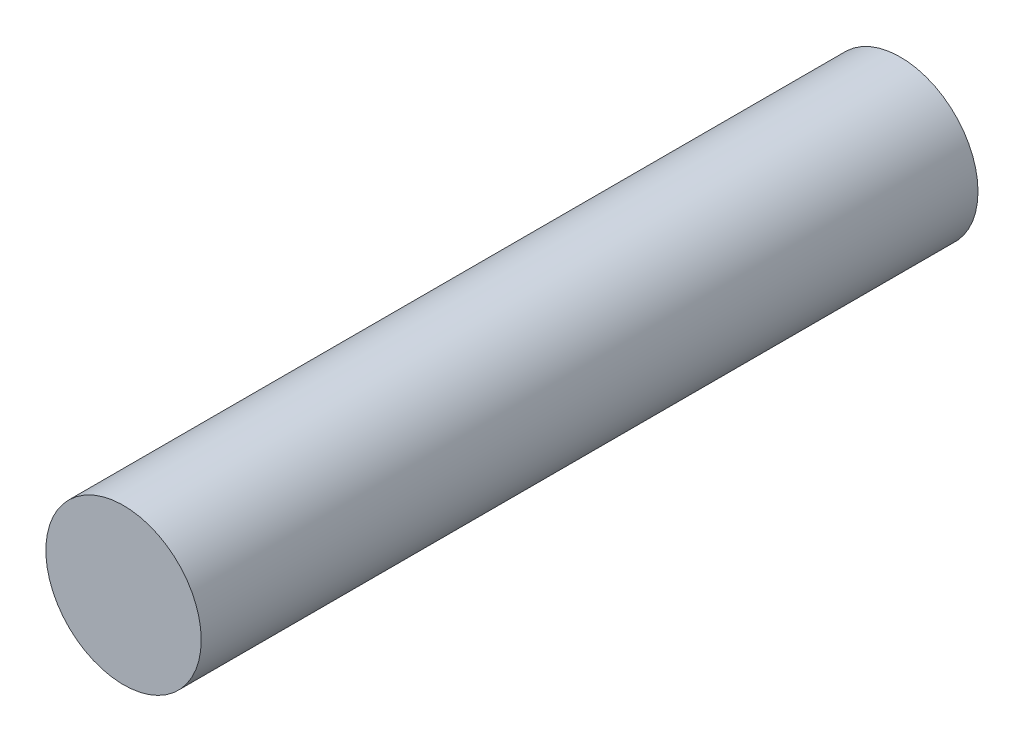
ISO-10303-21;
HEADER;
FILE_DESCRIPTION(('STEP AP214'),'2;1');
FILE_NAME('part.step','',(''),(''),'','','');
FILE_SCHEMA(('AUTOMOTIVE_DESIGN { 1 0 10303 214 1 1 1 1 }'));
ENDSEC;
DATA;
#1=APPLICATION_CONTEXT('core data for automotive mechanical design processes');
#2=APPLICATION_PROTOCOL_DEFINITION('international standard','automotive_design',2000,#1);
#3=PRODUCT_CONTEXT('',#1,'mechanical');
#4=PRODUCT('Part','Part','',(#3));
#5=PRODUCT_RELATED_PRODUCT_CATEGORY('part','',(#4));
#6=PRODUCT_DEFINITION_FORMATION('','',#4);
#7=PRODUCT_DEFINITION_CONTEXT('part definition',#1,'design');
#8=PRODUCT_DEFINITION('design','',#6,#7);
#9=PRODUCT_DEFINITION_SHAPE('','',#8);
#10=(LENGTH_UNIT() NAMED_UNIT(*) SI_UNIT(.MILLI.,.METRE.));
#11=(NAMED_UNIT(*) PLANE_ANGLE_UNIT() SI_UNIT($,.RADIAN.));
#12=(NAMED_UNIT(*) SI_UNIT($,.STERADIAN.) SOLID_ANGLE_UNIT());
#13=UNCERTAINTY_MEASURE_WITH_UNIT(LENGTH_MEASURE(1.E-05),#10,'distance_accuracy_value','');
#14=(GEOMETRIC_REPRESENTATION_CONTEXT(3) GLOBAL_UNCERTAINTY_ASSIGNED_CONTEXT((#13)) GLOBAL_UNIT_ASSIGNED_CONTEXT((#10,
#11,#12)) REPRESENTATION_CONTEXT('',''));
#15=CARTESIAN_POINT('',(0.,0.,0.));
#16=DIRECTION('',(0.,0.,1.));
#17=DIRECTION('',(1.,0.,0.));
#18=AXIS2_PLACEMENT_3D('',#15,#16,#17);
#19=CARTESIAN_POINT('',(0.,0.,100.));
#20=DIRECTION('',(0.,0.,-1.));
#21=DIRECTION('',(-1.,0.,0.));
#22=AXIS2_PLACEMENT_3D('',#19,#20,#21);
#23=CYLINDRICAL_SURFACE('',#22,10.);
#24=CARTESIAN_POINT('',(0.,0.,100.));
#25=DIRECTION('',(0.,0.,1.));
#26=DIRECTION('',(1.,0.,0.));
#27=AXIS2_PLACEMENT_3D('',#24,#25,#26);
#28=CIRCLE('',#27,10.);
#29=CARTESIAN_POINT('',(10.,0.,100.));
#30=VERTEX_POINT('',#29);
#31=EDGE_CURVE('E10',#30,#30,#28,.T.);
#32=ORIENTED_EDGE('',*,*,#31,.F.);
#33=EDGE_LOOP('',(#32));
#34=FACE_BOUND('',#33,.T.);
#35=CARTESIAN_POINT('',(0.,0.,0.));
#36=DIRECTION('',(0.,0.,1.));
#37=DIRECTION('',(1.,0.,0.));
#38=AXIS2_PLACEMENT_3D('',#35,#36,#37);
#39=CIRCLE('',#38,10.);
#40=CARTESIAN_POINT('',(10.,0.,0.));
#41=VERTEX_POINT('',#40);
#42=EDGE_CURVE('E39',#41,#41,#39,.T.);
#43=ORIENTED_EDGE('',*,*,#42,.T.);
#44=EDGE_LOOP('',(#43));
#45=FACE_BOUND('',#44,.T.);
#46=ADVANCED_FACE('F36',(#34,#45),#23,.T.);
#47=CARTESIAN_POINT('',(0.,0.,100.));
#48=DIRECTION('',(0.,0.,1.));
#49=DIRECTION('',(1.,0.,0.));
#50=AXIS2_PLACEMENT_3D('',#47,#48,#49);
#51=PLANE('',#50);
#52=ORIENTED_EDGE('',*,*,#31,.T.);
#53=EDGE_LOOP('',(#52));
#54=FACE_BOUND('',#53,.T.);
#55=ADVANCED_FACE('F65',(#54),#51,.T.);
#56=CARTESIAN_POINT('',(0.,0.,0.));
#57=DIRECTION('',(0.,0.,1.));
#58=DIRECTION('',(1.,0.,0.));
#59=AXIS2_PLACEMENT_3D('',#56,#57,#58);
#60=PLANE('',#59);
#61=CARTESIAN_POINT('',(0.,0.,0.));
#62=DIRECTION('',(0.,0.,-1.));
#63=DIRECTION('',(-1.,0.,0.));
#64=AXIS2_PLACEMENT_3D('',#61,#62,#63);
#65=CIRCLE('',#64,7.8);
#66=CARTESIAN_POINT('',(-7.8,0.,0.));
#67=VERTEX_POINT('',#66);
#68=EDGE_CURVE('E48',#67,#67,#65,.T.);
#69=ORIENTED_EDGE('',*,*,#68,.F.);
#70=EDGE_LOOP('',(#69));
#71=FACE_BOUND('',#70,.T.);
#72=ORIENTED_EDGE('',*,*,#42,.F.);
#73=EDGE_LOOP('',(#72));
#74=FACE_BOUND('',#73,.T.);
#75=ADVANCED_FACE('F59',(#71,#74),#60,.F.);
#76=CARTESIAN_POINT('',(0.,0.,19.));
#77=DIRECTION('',(0.,0.,-1.));
#78=DIRECTION('',(-1.,0.,0.));
#79=AXIS2_PLACEMENT_3D('',#76,#77,#78);
#80=CYLINDRICAL_SURFACE('',#79,7.8);
#81=CARTESIAN_POINT('',(0.,0.,19.));
#82=DIRECTION('',(0.,0.,-1.));
#83=DIRECTION('',(-1.,0.,0.));
#84=AXIS2_PLACEMENT_3D('',#81,#82,#83);
#85=CIRCLE('',#84,7.8);
#86=CARTESIAN_POINT('',(-7.8,0.,19.));
#87=VERTEX_POINT('',#86);
#88=EDGE_CURVE('E46',#87,#87,#85,.T.);
#89=ORIENTED_EDGE('',*,*,#88,.F.);
#90=EDGE_LOOP('',(#89));
#91=FACE_BOUND('',#90,.T.);
#92=ORIENTED_EDGE('',*,*,#68,.T.);
#93=EDGE_LOOP('',(#92));
#94=FACE_BOUND('',#93,.T.);
#95=ADVANCED_FACE('F56',(#91,#94),#80,.F.);
#96=CARTESIAN_POINT('',(0.,0.,19.));
#97=DIRECTION('',(0.,0.,-1.));
#98=DIRECTION('',(-1.,0.,0.));
#99=AXIS2_PLACEMENT_3D('',#96,#97,#98);
#100=PLANE('',#99);
#101=ORIENTED_EDGE('',*,*,#88,.T.);
#102=EDGE_LOOP('',(#101));
#103=FACE_BOUND('',#102,.T.);
#104=ADVANCED_FACE('F54',(#103),#100,.T.);
#105=CLOSED_SHELL('',(#46,#55,#75,#95,#104));
#106=MANIFOLD_SOLID_BREP('B2',#105);
#107=ADVANCED_BREP_SHAPE_REPRESENTATION('',(#18,#106),#14);
#108=SHAPE_DEFINITION_REPRESENTATION(#9,#107);
ENDSEC;
END-ISO-10303-21;
